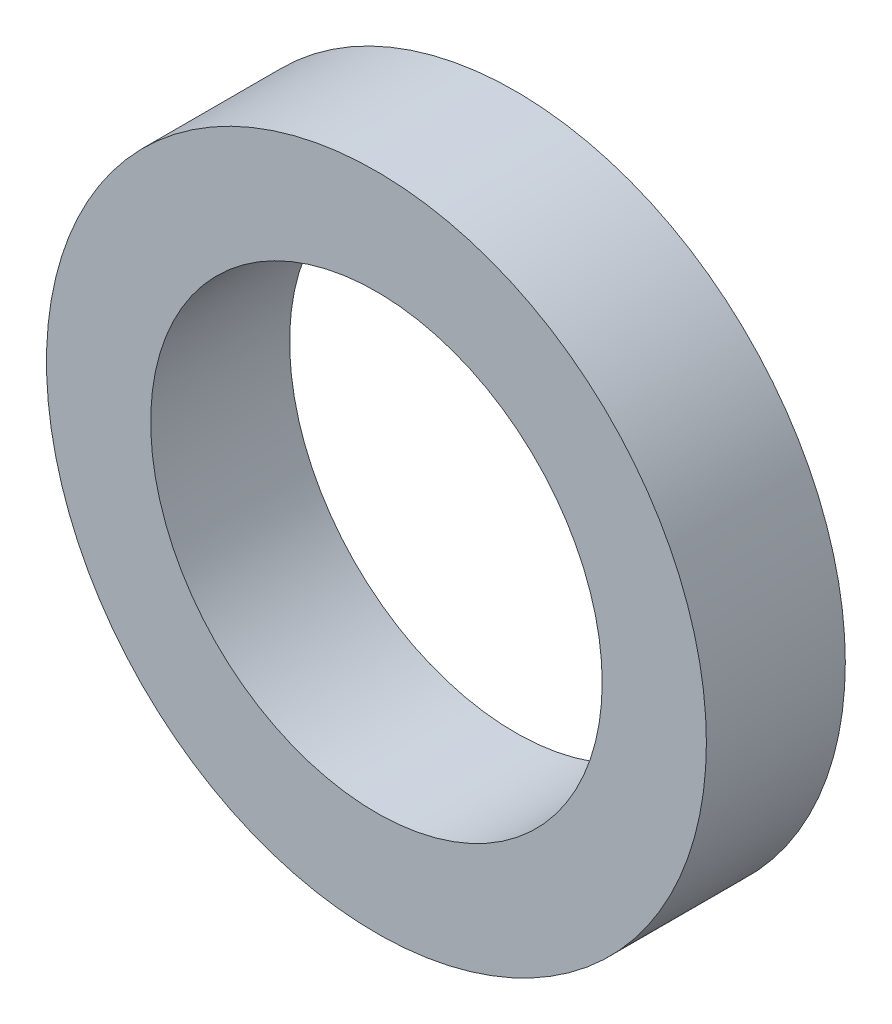
ISO-10303-21;
HEADER;
FILE_DESCRIPTION(('STEP AP214'),'2;1');
FILE_NAME('part.step','',(''),(''),'','','');
FILE_SCHEMA(('AUTOMOTIVE_DESIGN { 1 0 10303 214 1 1 1 1 }'));
ENDSEC;
DATA;
#1=APPLICATION_CONTEXT('core data for automotive mechanical design processes');
#2=APPLICATION_PROTOCOL_DEFINITION('international standard','automotive_design',2000,#1);
#3=PRODUCT_CONTEXT('',#1,'mechanical');
#4=PRODUCT('Part','Part','',(#3));
#5=PRODUCT_RELATED_PRODUCT_CATEGORY('part','',(#4));
#6=PRODUCT_DEFINITION_FORMATION('','',#4);
#7=PRODUCT_DEFINITION_CONTEXT('part definition',#1,'design');
#8=PRODUCT_DEFINITION('design','',#6,#7);
#9=PRODUCT_DEFINITION_SHAPE('','',#8);
#10=(LENGTH_UNIT() NAMED_UNIT(*) SI_UNIT(.MILLI.,.METRE.));
#11=(NAMED_UNIT(*) PLANE_ANGLE_UNIT() SI_UNIT($,.RADIAN.));
#12=(NAMED_UNIT(*) SI_UNIT($,.STERADIAN.) SOLID_ANGLE_UNIT());
#13=UNCERTAINTY_MEASURE_WITH_UNIT(LENGTH_MEASURE(1.E-05),#10,'distance_accuracy_value','');
#14=(GEOMETRIC_REPRESENTATION_CONTEXT(3) GLOBAL_UNCERTAINTY_ASSIGNED_CONTEXT((#13)) GLOBAL_UNIT_ASSIGNED_CONTEXT((#10,
#11,#12)) REPRESENTATION_CONTEXT('',''));
#15=CARTESIAN_POINT('',(0.,0.,0.));
#16=DIRECTION('',(0.,0.,1.));
#17=DIRECTION('',(1.,0.,0.));
#18=AXIS2_PLACEMENT_3D('',#15,#16,#17);
#19=CARTESIAN_POINT('',(0.,0.,4.));
#20=DIRECTION('',(0.,0.,1.));
#21=DIRECTION('',(1.,0.,0.));
#22=AXIS2_PLACEMENT_3D('',#19,#20,#21);
#23=PLANE('',#22);
#24=CARTESIAN_POINT('',(0.,0.,4.));
#25=DIRECTION('',(0.,0.,1.));
#26=DIRECTION('',(1.,0.,0.));
#27=AXIS2_PLACEMENT_3D('',#24,#25,#26);
#28=CIRCLE('',#27,9.5);
#29=CARTESIAN_POINT('',(9.5,0.,4.));
#30=VERTEX_POINT('',#29);
#31=EDGE_CURVE('E10',#30,#30,#28,.T.);
#32=ORIENTED_EDGE('',*,*,#31,.T.);
#33=EDGE_LOOP('',(#32));
#34=FACE_BOUND('',#33,.T.);
#35=CARTESIAN_POINT('',(0.,0.,4.));
#36=DIRECTION('',(0.,0.,1.));
#37=DIRECTION('',(1.,0.,0.));
#38=AXIS2_PLACEMENT_3D('',#35,#36,#37);
#39=CIRCLE('',#38,6.5);
#40=CARTESIAN_POINT('',(6.5,0.,4.));
#41=VERTEX_POINT('',#40);
#42=EDGE_CURVE('E48',#41,#41,#39,.T.);
#43=ORIENTED_EDGE('',*,*,#42,.F.);
#44=EDGE_LOOP('',(#43));
#45=FACE_BOUND('',#44,.T.);
#46=ADVANCED_FACE('F37',(#34,#45),#23,.T.);
#47=CARTESIAN_POINT('',(0.,0.,0.));
#48=DIRECTION('',(0.,0.,1.));
#49=DIRECTION('',(1.,0.,0.));
#50=AXIS2_PLACEMENT_3D('',#47,#48,#49);
#51=PLANE('',#50);
#52=CARTESIAN_POINT('',(0.,0.,0.));
#53=DIRECTION('',(0.,0.,1.));
#54=DIRECTION('',(1.,0.,0.));
#55=AXIS2_PLACEMENT_3D('',#52,#53,#54);
#56=CIRCLE('',#55,9.5);
#57=CARTESIAN_POINT('',(9.5,0.,0.));
#58=VERTEX_POINT('',#57);
#59=EDGE_CURVE('E41',#58,#58,#56,.T.);
#60=ORIENTED_EDGE('',*,*,#59,.F.);
#61=EDGE_LOOP('',(#60));
#62=FACE_BOUND('',#61,.T.);
#63=CARTESIAN_POINT('',(0.,0.,0.));
#64=DIRECTION('',(0.,0.,1.));
#65=DIRECTION('',(1.,0.,0.));
#66=AXIS2_PLACEMENT_3D('',#63,#64,#65);
#67=CIRCLE('',#66,6.5);
#68=CARTESIAN_POINT('',(6.5,0.,0.));
#69=VERTEX_POINT('',#68);
#70=EDGE_CURVE('E50',#69,#69,#67,.T.);
#71=ORIENTED_EDGE('',*,*,#70,.T.);
#72=EDGE_LOOP('',(#71));
#73=FACE_BOUND('',#72,.T.);
#74=ADVANCED_FACE('F60',(#62,#73),#51,.F.);
#75=CARTESIAN_POINT('',(0.,0.,4.));
#76=DIRECTION('',(0.,0.,-1.));
#77=DIRECTION('',(-1.,0.,0.));
#78=AXIS2_PLACEMENT_3D('',#75,#76,#77);
#79=CYLINDRICAL_SURFACE('',#78,9.5);
#80=ORIENTED_EDGE('',*,*,#31,.F.);
#81=EDGE_LOOP('',(#80));
#82=FACE_BOUND('',#81,.T.);
#83=ORIENTED_EDGE('',*,*,#59,.T.);
#84=EDGE_LOOP('',(#83));
#85=FACE_BOUND('',#84,.T.);
#86=ADVANCED_FACE('F39',(#82,#85),#79,.T.);
#87=CARTESIAN_POINT('',(0.,0.,4.));
#88=DIRECTION('',(0.,0.,-1.));
#89=DIRECTION('',(-1.,0.,0.));
#90=AXIS2_PLACEMENT_3D('',#87,#88,#89);
#91=CYLINDRICAL_SURFACE('',#90,6.5);
#92=ORIENTED_EDGE('',*,*,#42,.T.);
#93=EDGE_LOOP('',(#92));
#94=FACE_BOUND('',#93,.T.);
#95=ORIENTED_EDGE('',*,*,#70,.F.);
#96=EDGE_LOOP('',(#95));
#97=FACE_BOUND('',#96,.T.);
#98=ADVANCED_FACE('F56',(#94,#97),#91,.F.);
#99=CLOSED_SHELL('',(#46,#74,#86,#98));
#100=MANIFOLD_SOLID_BREP('B2',#99);
#101=ADVANCED_BREP_SHAPE_REPRESENTATION('',(#18,#100),#14);
#102=SHAPE_DEFINITION_REPRESENTATION(#9,#101);
ENDSEC;
END-ISO-10303-21;
